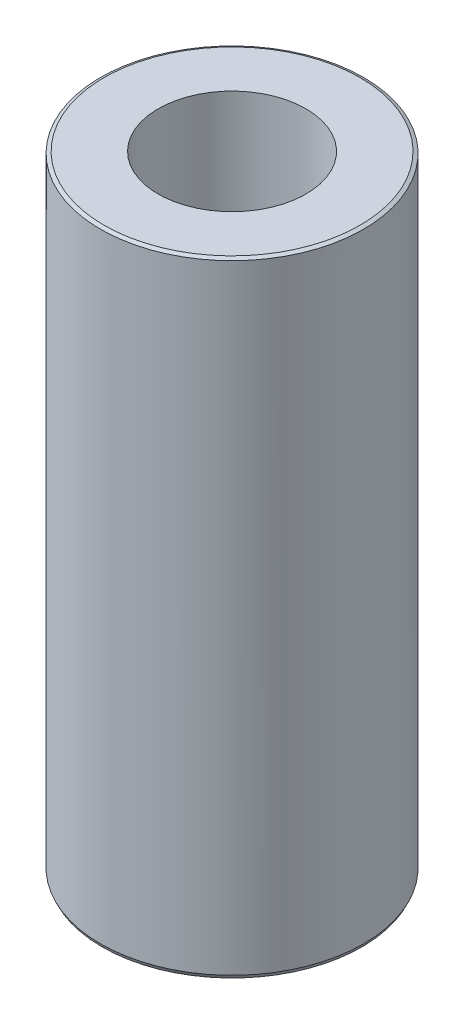
ISO-10303-21;
HEADER;
FILE_DESCRIPTION(('STEP AP214'),'2;1');
FILE_NAME('part.step','',(''),(''),'','','');
FILE_SCHEMA(('AUTOMOTIVE_DESIGN { 1 0 10303 214 1 1 1 1 }'));
ENDSEC;
DATA;
#1=APPLICATION_CONTEXT('core data for automotive mechanical design processes');
#2=APPLICATION_PROTOCOL_DEFINITION('international standard','automotive_design',2000,#1);
#3=PRODUCT_CONTEXT('',#1,'mechanical');
#4=PRODUCT('Part','Part','',(#3));
#5=PRODUCT_RELATED_PRODUCT_CATEGORY('part','',(#4));
#6=PRODUCT_DEFINITION_FORMATION('','',#4);
#7=PRODUCT_DEFINITION_CONTEXT('part definition',#1,'design');
#8=PRODUCT_DEFINITION('design','',#6,#7);
#9=PRODUCT_DEFINITION_SHAPE('','',#8);
#10=(LENGTH_UNIT() NAMED_UNIT(*) SI_UNIT(.MILLI.,.METRE.));
#11=(NAMED_UNIT(*) PLANE_ANGLE_UNIT() SI_UNIT($,.RADIAN.));
#12=(NAMED_UNIT(*) SI_UNIT($,.STERADIAN.) SOLID_ANGLE_UNIT());
#13=UNCERTAINTY_MEASURE_WITH_UNIT(LENGTH_MEASURE(1.E-05),#10,'distance_accuracy_value','');
#14=(GEOMETRIC_REPRESENTATION_CONTEXT(3) GLOBAL_UNCERTAINTY_ASSIGNED_CONTEXT((#13)) GLOBAL_UNIT_ASSIGNED_CONTEXT((#10,
#11,#12)) REPRESENTATION_CONTEXT('',''));
#15=CARTESIAN_POINT('',(0.,0.,0.));
#16=DIRECTION('',(0.,0.,1.));
#17=DIRECTION('',(1.,0.,0.));
#18=AXIS2_PLACEMENT_3D('',#15,#16,#17);
#19=CARTESIAN_POINT('',(0.,237.249576593395,0.));
#20=DIRECTION('',(0.,-1.,0.));
#21=DIRECTION('',(0.,0.,-1.));
#22=AXIS2_PLACEMENT_3D('',#19,#20,#21);
#23=CYLINDRICAL_SURFACE('',#22,50.);
#24=CARTESIAN_POINT('',(0.,236.618357845826,0.));
#25=DIRECTION('',(0.,1.,0.));
#26=DIRECTION('',(0.,0.,1.));
#27=AXIS2_PLACEMENT_3D('',#24,#25,#26);
#28=CIRCLE('',#27,50.);
#29=CARTESIAN_POINT('',(0.,236.618357845826,-50.));
#30=VERTEX_POINT('',#29);
#31=EDGE_CURVE('E50',#30,#30,#28,.F.);
#32=CARTESIAN_POINT('',(0.,1.3515327547623,0.));
#33=DIRECTION('',(0.,1.,0.));
#34=DIRECTION('',(0.,0.,1.));
#35=AXIS2_PLACEMENT_3D('',#32,#33,#34);
#36=CIRCLE('',#35,50.);
#37=CARTESIAN_POINT('',(0.,1.35153275476227,-50.));
#38=VERTEX_POINT('',#37);
#39=EDGE_CURVE('E51',#38,#38,#36,.T.);
#40=CARTESIAN_POINT('',(0.,236.618357845826,-50.));
#41=CARTESIAN_POINT('',(0.,234.167661751127,-50.));
#42=CARTESIAN_POINT('',(0.,231.716965656429,-50.));
#43=CARTESIAN_POINT('',(0.,226.815573467032,-50.));
#44=CARTESIAN_POINT('',(0.,224.364877372333,-50.));
#45=CARTESIAN_POINT('',(0.,219.463485182936,-50.));
#46=CARTESIAN_POINT('',(0.,217.012789088237,-50.));
#47=CARTESIAN_POINT('',(0.,212.11139689884,-50.));
#48=CARTESIAN_POINT('',(0.,209.660700804142,-50.));
#49=CARTESIAN_POINT('',(0.,204.759308614744,-50.));
#50=CARTESIAN_POINT('',(0.,202.308612520046,-50.));
#51=CARTESIAN_POINT('',(0.,197.407220330649,-50.));
#52=CARTESIAN_POINT('',(0.,194.95652423595,-50.));
#53=CARTESIAN_POINT('',(0.,190.055132046553,-50.));
#54=CARTESIAN_POINT('',(0.,187.604435951854,-50.));
#55=CARTESIAN_POINT('',(0.,182.703043762457,-50.));
#56=CARTESIAN_POINT('',(0.,180.252347667759,-50.));
#57=CARTESIAN_POINT('',(0.,175.350955478361,-50.));
#58=CARTESIAN_POINT('',(0.,172.900259383663,-50.));
#59=CARTESIAN_POINT('',(0.,167.998867194266,-50.));
#60=CARTESIAN_POINT('',(0.,165.548171099567,-50.));
#61=CARTESIAN_POINT('',(0.,160.64677891017,-50.));
#62=CARTESIAN_POINT('',(0.,158.196082815471,-50.));
#63=CARTESIAN_POINT('',(0.,153.294690626074,-50.));
#64=CARTESIAN_POINT('',(0.,150.843994531376,-50.));
#65=CARTESIAN_POINT('',(0.,145.942602341978,-50.));
#66=CARTESIAN_POINT('',(0.,143.49190624728,-50.));
#67=CARTESIAN_POINT('',(0.,138.590514057883,-50.));
#68=CARTESIAN_POINT('',(0.,136.139817963184,-50.));
#69=CARTESIAN_POINT('',(0.,131.238425773787,-50.));
#70=CARTESIAN_POINT('',(0.,128.787729679088,-50.));
#71=CARTESIAN_POINT('',(0.,123.886337489691,-50.));
#72=CARTESIAN_POINT('',(0.,121.435641394993,-50.));
#73=CARTESIAN_POINT('',(0.,116.534249205596,-50.));
#74=CARTESIAN_POINT('',(0.,114.083553110897,-50.));
#75=CARTESIAN_POINT('',(0.,109.1821609215,-50.));
#76=CARTESIAN_POINT('',(0.,106.731464826801,-50.));
#77=CARTESIAN_POINT('',(0.,101.830072637404,-50.));
#78=CARTESIAN_POINT('',(0.,99.3793765427055,-50.));
#79=CARTESIAN_POINT('',(0.,94.4779843533083,-50.));
#80=CARTESIAN_POINT('',(0.,92.0272882586097,-50.));
#81=CARTESIAN_POINT('',(0.,87.1258960692126,-50.));
#82=CARTESIAN_POINT('',(0.,84.675199974514,-50.));
#83=CARTESIAN_POINT('',(0.,79.7738077851168,-50.));
#84=CARTESIAN_POINT('',(0.,77.3231116904182,-50.));
#85=CARTESIAN_POINT('',(0.,72.4217195010211,-50.));
#86=CARTESIAN_POINT('',(0.,69.9710234063225,-50.));
#87=CARTESIAN_POINT('',(0.,65.0696312169253,-50.));
#88=CARTESIAN_POINT('',(0.,62.6189351222268,-50.));
#89=CARTESIAN_POINT('',(0.,57.7175429328296,-50.));
#90=CARTESIAN_POINT('',(0.,55.266846838131,-50.));
#91=CARTESIAN_POINT('',(0.,50.3654546487339,-50.));
#92=CARTESIAN_POINT('',(0.,47.9147585540353,-50.));
#93=CARTESIAN_POINT('',(0.,43.0133663646381,-50.));
#94=CARTESIAN_POINT('',(0.,40.5626702699395,-50.));
#95=CARTESIAN_POINT('',(0.,35.6612780805424,-50.));
#96=CARTESIAN_POINT('',(0.,33.2105819858438,-50.));
#97=CARTESIAN_POINT('',(0.,28.3091897964466,-50.));
#98=CARTESIAN_POINT('',(0.,25.8584937017481,-50.));
#99=CARTESIAN_POINT('',(0.,20.9571015123509,-50.));
#100=CARTESIAN_POINT('',(0.,18.5064054176523,-50.));
#101=CARTESIAN_POINT('',(0.,13.6050132282552,-50.));
#102=CARTESIAN_POINT('',(0.,11.1543171335566,-50.));
#103=CARTESIAN_POINT('',(0.,6.25292494415942,-50.));
#104=CARTESIAN_POINT('',(0.,3.80222884946084,-50.));
#105=CARTESIAN_POINT('',(0.,1.35153275476227,-50.));
#106=B_SPLINE_CURVE_WITH_KNOTS('',3,(#40,#41,#42,#43,#44,#45,#46,#47,#48,#49,#50,#51,#52,#53,
#54,#55,#56,#57,#58,#59,#60,#61,#62,#63,#64,#65,#66,#67,#68,#69,#70,#71,#72,#73,#74,#75,#76,#77,
#78,#79,#80,#81,#82,#83,#84,#85,#86,#87,#88,#89,#90,#91,#92,#93,#94,#95,#96,#97,#98,#99,#100,
#101,#102,#103,#104,#105),.UNSPECIFIED.,.F.,.F.,(4,2,2,2,2,2,2,2,2,2,2,2,2,2,2,2,2,2,2,2,2,2,2,
2,2,2,2,2,2,2,2,2,4),(0.,7.35208828409573,14.7041765681915,22.0562648522872,29.4083531363829,
36.7604414204787,44.1125297045744,51.4646179886702,58.8167062727659,66.1687945568616,
73.5208828409573,80.8729711250531,88.2250594091489,95.5771476932446,102.92923597734,
110.281324261436,117.633412545532,124.985500829628,132.337589113723,139.689677397819,
147.041765681915,154.39385396601,161.745942250106,169.098030534202,176.450118818298,
183.802207102393,191.154295386489,198.506383670585,205.858471954681,213.210560238776,
220.562648522872,227.914736806968,235.266825091064),.UNSPECIFIED.);
#107=EDGE_CURVE('BSEAM39',#30,#38,#106,.T.);
#108=ORIENTED_EDGE('',*,*,#31,.T.);
#109=ORIENTED_EDGE('',*,*,#39,.T.);
#110=ORIENTED_EDGE('',*,*,#107,.T.);
#111=ORIENTED_EDGE('',*,*,#107,.F.);
#112=EDGE_LOOP('',(#108,#110,#109,#111));
#113=FACE_BOUND('',#112,.T.);
#114=ADVANCED_FACE('F39',(#113),#23,.T.);
#115=CARTESIAN_POINT('',(0.,237.249576593395,0.));
#116=DIRECTION('',(0.,1.,0.));
#117=DIRECTION('',(0.,0.,1.));
#118=AXIS2_PLACEMENT_3D('',#115,#116,#117);
#119=PLANE('',#118);
#120=CARTESIAN_POINT('',(0.,237.249576593395,0.));
#121=DIRECTION('',(0.,1.,0.));
#122=DIRECTION('',(0.,0.,1.));
#123=AXIS2_PLACEMENT_3D('',#120,#121,#122);
#124=CIRCLE('',#123,48.6484672452382);
#125=CARTESIAN_POINT('',(0.,237.249576593395,48.6484672452382));
#126=VERTEX_POINT('',#125);
#127=EDGE_CURVE('E54',#126,#126,#124,.T.);
#128=ORIENTED_EDGE('',*,*,#127,.T.);
#129=EDGE_LOOP('',(#128));
#130=FACE_BOUND('',#129,.T.);
#131=CARTESIAN_POINT('',(0.,237.249576593395,0.));
#132=DIRECTION('',(0.,1.,0.));
#133=DIRECTION('',(0.,0.,1.));
#134=AXIS2_PLACEMENT_3D('',#131,#132,#133);
#135=CIRCLE('',#134,28.0944082841839);
#136=CARTESIAN_POINT('',(0.,237.249576593395,-28.0944082841839));
#137=VERTEX_POINT('',#136);
#138=EDGE_CURVE('E58',#137,#137,#135,.T.);
#139=ORIENTED_EDGE('',*,*,#138,.F.);
#140=EDGE_LOOP('',(#139));
#141=FACE_BOUND('',#140,.T.);
#142=ADVANCED_FACE('F69',(#130,#141),#119,.T.);
#143=CARTESIAN_POINT('',(0.,0.,0.));
#144=DIRECTION('',(0.,1.,0.));
#145=DIRECTION('',(0.,0.,1.));
#146=AXIS2_PLACEMENT_3D('',#143,#144,#145);
#147=PLANE('',#146);
#148=CARTESIAN_POINT('',(0.,0.,0.));
#149=DIRECTION('',(0.,1.,0.));
#150=DIRECTION('',(0.,0.,1.));
#151=AXIS2_PLACEMENT_3D('',#148,#149,#150);
#152=CIRCLE('',#151,49.368781252431);
#153=CARTESIAN_POINT('',(0.,0.,49.368781252431));
#154=VERTEX_POINT('',#153);
#155=EDGE_CURVE('E10',#154,#154,#152,.F.);
#156=ORIENTED_EDGE('',*,*,#155,.T.);
#157=EDGE_LOOP('',(#156));
#158=FACE_BOUND('',#157,.T.);
#159=CARTESIAN_POINT('',(0.,0.,0.));
#160=DIRECTION('',(0.,1.,0.));
#161=DIRECTION('',(0.,0.,1.));
#162=AXIS2_PLACEMENT_3D('',#159,#160,#161);
#163=CIRCLE('',#162,28.0944082841839);
#164=CARTESIAN_POINT('',(0.,0.,-28.0944082841839));
#165=VERTEX_POINT('',#164);
#166=EDGE_CURVE('E63',#165,#165,#163,.T.);
#167=ORIENTED_EDGE('',*,*,#166,.T.);
#168=EDGE_LOOP('',(#167));
#169=FACE_BOUND('',#168,.T.);
#170=ADVANCED_FACE('F75',(#158,#169),#147,.F.);
#171=CARTESIAN_POINT('',(0.,237.249576593395,0.));
#172=DIRECTION('',(0.,-1.,0.));
#173=DIRECTION('',(0.,0.,-1.));
#174=AXIS2_PLACEMENT_3D('',#171,#172,#173);
#175=CYLINDRICAL_SURFACE('',#174,28.0944082841839);
#176=CARTESIAN_POINT('',(0.,237.249576593395,-28.0944082841839));
#177=CARTESIAN_POINT('',(0.,234.778226837213,-28.0944082841839));
#178=CARTESIAN_POINT('',(0.,232.306877081032,-28.0944082841839));
#179=CARTESIAN_POINT('',(0.,227.36417756867,-28.0944082841839));
#180=CARTESIAN_POINT('',(0.,224.892827812489,-28.0944082841839));
#181=CARTESIAN_POINT('',(0.,219.950128300126,-28.0944082841839));
#182=CARTESIAN_POINT('',(0.,217.478778543945,-28.0944082841839));
#183=CARTESIAN_POINT('',(0.,212.536079031583,-28.0944082841839));
#184=CARTESIAN_POINT('',(0.,210.064729275401,-28.0944082841839));
#185=CARTESIAN_POINT('',(0.,205.122029763039,-28.0944082841839));
#186=CARTESIAN_POINT('',(0.,202.650680006858,-28.0944082841839));
#187=CARTESIAN_POINT('',(0.,197.707980494496,-28.0944082841839));
#188=CARTESIAN_POINT('',(0.,195.236630738314,-28.0944082841839));
#189=CARTESIAN_POINT('',(0.,190.293931225952,-28.0944082841839));
#190=CARTESIAN_POINT('',(0.,187.822581469771,-28.0944082841839));
#191=CARTESIAN_POINT('',(0.,182.879881957408,-28.0944082841839));
#192=CARTESIAN_POINT('',(0.,180.408532201227,-28.0944082841839));
#193=CARTESIAN_POINT('',(0.,175.465832688865,-28.0944082841839));
#194=CARTESIAN_POINT('',(0.,172.994482932684,-28.0944082841839));
#195=CARTESIAN_POINT('',(0.,168.051783420321,-28.0944082841839));
#196=CARTESIAN_POINT('',(0.,165.58043366414,-28.0944082841839));
#197=CARTESIAN_POINT('',(0.,160.637734151778,-28.0944082841839));
#198=CARTESIAN_POINT('',(0.,158.166384395596,-28.0944082841839));
#199=CARTESIAN_POINT('',(0.,153.223684883234,-28.0944082841839));
#200=CARTESIAN_POINT('',(0.,150.752335127053,-28.0944082841839));
#201=CARTESIAN_POINT('',(0.,145.80963561469,-28.0944082841839));
#202=CARTESIAN_POINT('',(0.,143.338285858509,-28.0944082841839));
#203=CARTESIAN_POINT('',(0.,138.395586346147,-28.0944082841839));
#204=CARTESIAN_POINT('',(0.,135.924236589966,-28.0944082841839));
#205=CARTESIAN_POINT('',(0.,130.981537077603,-28.0944082841839));
#206=CARTESIAN_POINT('',(0.,128.510187321422,-28.0944082841839));
#207=CARTESIAN_POINT('',(0.,123.56748780906,-28.0944082841839));
#208=CARTESIAN_POINT('',(0.,121.096138052878,-28.0944082841839));
#209=CARTESIAN_POINT('',(0.,116.153438540516,-28.0944082841839));
#210=CARTESIAN_POINT('',(0.,113.682088784335,-28.0944082841839));
#211=CARTESIAN_POINT('',(0.,108.739389271972,-28.0944082841839));
#212=CARTESIAN_POINT('',(0.,106.268039515791,-28.0944082841839));
#213=CARTESIAN_POINT('',(0.,101.325340003429,-28.0944082841839));
#214=CARTESIAN_POINT('',(0.,98.8539902472477,-28.0944082841839));
#215=CARTESIAN_POINT('',(0.,93.9112907348853,-28.0944082841839));
#216=CARTESIAN_POINT('',(0.,91.4399409787042,-28.0944082841839));
#217=CARTESIAN_POINT('',(0.,86.4972414663418,-28.0944082841839));
#218=CARTESIAN_POINT('',(0.,84.0258917101606,-28.0944082841839));
#219=CARTESIAN_POINT('',(0.,79.0831921977982,-28.0944082841839));
#220=CARTESIAN_POINT('',(0.,76.611842441617,-28.0944082841839));
#221=CARTESIAN_POINT('',(0.,71.6691429292546,-28.0944082841839));
#222=CARTESIAN_POINT('',(0.,69.1977931730734,-28.0944082841839));
#223=CARTESIAN_POINT('',(0.,64.255093660711,-28.0944082841839));
#224=CARTESIAN_POINT('',(0.,61.7837439045298,-28.0944082841839));
#225=CARTESIAN_POINT('',(0.,56.8410443921674,-28.0944082841839));
#226=CARTESIAN_POINT('',(0.,54.3696946359862,-28.0944082841839));
#227=CARTESIAN_POINT('',(0.,49.4269951236239,-28.0944082841839));
#228=CARTESIAN_POINT('',(0.,46.9556453674427,-28.0944082841839));
#229=CARTESIAN_POINT('',(0.,42.0129458550803,-28.0944082841839));
#230=CARTESIAN_POINT('',(0.,39.5415960988991,-28.0944082841839));
#231=CARTESIAN_POINT('',(0.,34.5988965865367,-28.0944082841839));
#232=CARTESIAN_POINT('',(0.,32.1275468303555,-28.0944082841839));
#233=CARTESIAN_POINT('',(0.,27.1848473179931,-28.0944082841839));
#234=CARTESIAN_POINT('',(0.,24.7134975618119,-28.0944082841839));
#235=CARTESIAN_POINT('',(0.,19.7707980494495,-28.0944082841839));
#236=CARTESIAN_POINT('',(0.,17.2994482932683,-28.0944082841839));
#237=CARTESIAN_POINT('',(0.,12.3567487809059,-28.0944082841839));
#238=CARTESIAN_POINT('',(0.,9.88539902472475,-28.0944082841839));
#239=CARTESIAN_POINT('',(0.,4.94269951236236,-28.0944082841839));
#240=CARTESIAN_POINT('',(0.,2.47134975618116,-28.0944082841839));
#241=CARTESIAN_POINT('',(0.,0.,-28.0944082841839));
#242=B_SPLINE_CURVE_WITH_KNOTS('',3,(#176,#177,#178,#179,#180,#181,#182,#183,#184,#185,#186,
#187,#188,#189,#190,#191,#192,#193,#194,#195,#196,#197,#198,#199,#200,#201,#202,#203,#204,#205,
#206,#207,#208,#209,#210,#211,#212,#213,#214,#215,#216,#217,#218,#219,#220,#221,#222,#223,#224,
#225,#226,#227,#228,#229,#230,#231,#232,#233,#234,#235,#236,#237,#238,#239,#240,#241),
.UNSPECIFIED.,.F.,.F.,(4,2,2,2,2,2,2,2,2,2,2,2,2,2,2,2,2,2,2,2,2,2,2,2,2,2,2,2,2,2,2,2,4),(0.,
7.41404926854358,14.8280985370871,22.2421478056307,29.6561970741743,37.0702463427179,
44.4842956112615,51.8983448798051,59.3123941483486,66.7264434168922,74.1404926854358,
81.5545419539794,88.968591222523,96.3826404910666,103.79668975961,111.210739028154,
118.624788296697,126.038837565241,133.452886833784,140.866936102328,148.280985370872,
155.695034639415,163.109083907959,170.523133176502,177.937182445046,185.35123171359,
192.765280982133,200.179330250677,207.59337951922,215.007428787764,222.421478056307,
229.835527324851,237.249576593395),.UNSPECIFIED.);
#243=EDGE_CURVE('BSEAM70',#137,#165,#242,.T.);
#244=ORIENTED_EDGE('',*,*,#138,.T.);
#245=ORIENTED_EDGE('',*,*,#166,.F.);
#246=ORIENTED_EDGE('',*,*,#243,.T.);
#247=ORIENTED_EDGE('',*,*,#243,.F.);
#248=EDGE_LOOP('',(#244,#246,#245,#247));
#249=FACE_BOUND('',#248,.T.);
#250=ADVANCED_FACE('F70',(#249),#175,.F.);
#251=CARTESIAN_POINT('',(0.,237.249576593395,0.));
#252=DIRECTION('',(0.,-1.,0.));
#253=DIRECTION('',(0.,0.,-1.));
#254=AXIS2_PLACEMENT_3D('',#251,#252,#253);
#255=CONICAL_SURFACE('',#254,48.6484672452382,1.13386331585588);
#256=ORIENTED_EDGE('',*,*,#31,.F.);
#257=EDGE_LOOP('',(#256));
#258=FACE_BOUND('',#257,.T.);
#259=ORIENTED_EDGE('',*,*,#127,.F.);
#260=EDGE_LOOP('',(#259));
#261=FACE_BOUND('',#260,.T.);
#262=ADVANCED_FACE('F81',(#258,#261),#255,.T.);
#263=CARTESIAN_POINT('',(0.,1.3515327547623,0.));
#264=DIRECTION('',(0.,1.,0.));
#265=DIRECTION('',(0.,0.,1.));
#266=AXIS2_PLACEMENT_3D('',#263,#264,#265);
#267=CONICAL_SURFACE('',#266,50.,0.436933010939037);
#268=ORIENTED_EDGE('',*,*,#155,.F.);
#269=EDGE_LOOP('',(#268));
#270=FACE_BOUND('',#269,.T.);
#271=ORIENTED_EDGE('',*,*,#39,.F.);
#272=EDGE_LOOP('',(#271));
#273=FACE_BOUND('',#272,.T.);
#274=ADVANCED_FACE('F45',(#270,#273),#267,.T.);
#275=CLOSED_SHELL('',(#114,#142,#170,#250,#262,#274));
#276=MANIFOLD_SOLID_BREP('B2',#275);
#277=ADVANCED_BREP_SHAPE_REPRESENTATION('',(#18,#276),#14);
#278=SHAPE_DEFINITION_REPRESENTATION(#9,#277);
ENDSEC;
END-ISO-10303-21;
